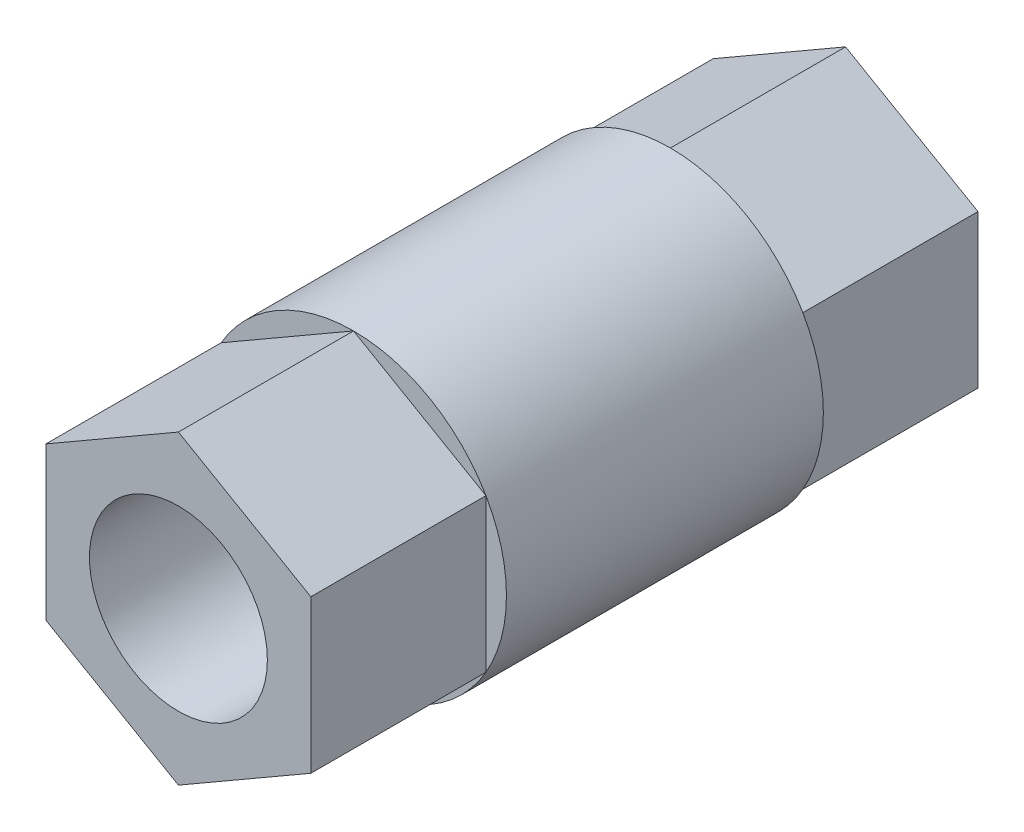
ISO-10303-21;
HEADER;
FILE_DESCRIPTION(('STEP AP214'),'2;1');
FILE_NAME('part.step','',(''),(''),'','','');
FILE_SCHEMA(('AUTOMOTIVE_DESIGN { 1 0 10303 214 1 1 1 1 }'));
ENDSEC;
DATA;
#1=APPLICATION_CONTEXT('core data for automotive mechanical design processes');
#2=APPLICATION_PROTOCOL_DEFINITION('international standard','automotive_design',2000,#1);
#3=PRODUCT_CONTEXT('',#1,'mechanical');
#4=PRODUCT('Part','Part','',(#3));
#5=PRODUCT_RELATED_PRODUCT_CATEGORY('part','',(#4));
#6=PRODUCT_DEFINITION_FORMATION('','',#4);
#7=PRODUCT_DEFINITION_CONTEXT('part definition',#1,'design');
#8=PRODUCT_DEFINITION('design','',#6,#7);
#9=PRODUCT_DEFINITION_SHAPE('','',#8);
#10=(LENGTH_UNIT() NAMED_UNIT(*) SI_UNIT(.MILLI.,.METRE.));
#11=(NAMED_UNIT(*) PLANE_ANGLE_UNIT() SI_UNIT($,.RADIAN.));
#12=(NAMED_UNIT(*) SI_UNIT($,.STERADIAN.) SOLID_ANGLE_UNIT());
#13=UNCERTAINTY_MEASURE_WITH_UNIT(LENGTH_MEASURE(1.E-05),#10,'distance_accuracy_value','');
#14=(GEOMETRIC_REPRESENTATION_CONTEXT(3) GLOBAL_UNCERTAINTY_ASSIGNED_CONTEXT((#13)) GLOBAL_UNIT_ASSIGNED_CONTEXT((#10,
#11,#12)) REPRESENTATION_CONTEXT('',''));
#15=CARTESIAN_POINT('',(0.,0.,0.));
#16=DIRECTION('',(0.,0.,1.));
#17=DIRECTION('',(1.,0.,0.));
#18=AXIS2_PLACEMENT_3D('',#15,#16,#17);
#19=CARTESIAN_POINT('',(0.,0.,11.4));
#20=DIRECTION('',(0.,0.,1.));
#21=DIRECTION('',(1.,0.,0.));
#22=AXIS2_PLACEMENT_3D('',#19,#20,#21);
#23=PLANE('',#22);
#24=CARTESIAN_POINT('',(0.,0.,11.4));
#25=DIRECTION('',(0.,0.,1.));
#26=DIRECTION('',(1.,0.,0.));
#27=AXIS2_PLACEMENT_3D('',#24,#25,#26);
#28=CIRCLE('',#27,11.);
#29=CARTESIAN_POINT('',(-9.52627944162882,5.5,11.4));
#30=VERTEX_POINT('',#29);
#31=CARTESIAN_POINT('',(-9.52627944162882,-5.5,11.4));
#32=VERTEX_POINT('',#31);
#33=EDGE_CURVE('E318',#30,#32,#28,.T.);
#34=ORIENTED_EDGE('',*,*,#33,.T.);
#35=DIRECTION('',(0.,1.,0.));
#36=VECTOR('',#35,1.);
#37=CARTESIAN_POINT('',(-9.52627944162882,0.,11.4));
#38=LINE('',#37,#36);
#39=EDGE_CURVE('E152',#32,#30,#38,.T.);
#40=ORIENTED_EDGE('',*,*,#39,.T.);
#41=EDGE_LOOP('',(#34,#40));
#42=FACE_BOUND('',#41,.T.);
#43=ADVANCED_FACE('F38',(#42),#23,.T.);
#44=CARTESIAN_POINT('',(0.,-11.,11.4));
#45=VERTEX_POINT('',#44);
#46=EDGE_CURVE('E319',#32,#45,#28,.T.);
#47=ORIENTED_EDGE('',*,*,#46,.T.);
#48=DIRECTION('',(-0.866025403784439,0.5,0.));
#49=VECTOR('',#48,1.);
#50=CARTESIAN_POINT('',(-4.76313972081441,-8.25,11.4));
#51=LINE('',#50,#49);
#52=EDGE_CURVE('E174',#45,#32,#51,.T.);
#53=ORIENTED_EDGE('',*,*,#52,.T.);
#54=EDGE_LOOP('',(#47,#53));
#55=FACE_BOUND('',#54,.T.);
#56=ADVANCED_FACE('F296',(#55),#23,.T.);
#57=CARTESIAN_POINT('',(9.52627944162883,-5.5,11.4));
#58=VERTEX_POINT('',#57);
#59=EDGE_CURVE('E321',#45,#58,#28,.T.);
#60=ORIENTED_EDGE('',*,*,#59,.T.);
#61=DIRECTION('',(-0.866025403784439,-0.5,0.));
#62=VECTOR('',#61,1.);
#63=CARTESIAN_POINT('',(4.76313972081441,-8.25,11.4));
#64=LINE('',#63,#62);
#65=EDGE_CURVE('E171',#58,#45,#64,.T.);
#66=ORIENTED_EDGE('',*,*,#65,.T.);
#67=EDGE_LOOP('',(#60,#66));
#68=FACE_BOUND('',#67,.T.);
#69=ADVANCED_FACE('F301',(#68),#23,.T.);
#70=CARTESIAN_POINT('',(9.52627944162882,5.5,11.4));
#71=VERTEX_POINT('',#70);
#72=EDGE_CURVE('E183',#58,#71,#28,.T.);
#73=ORIENTED_EDGE('',*,*,#72,.T.);
#74=DIRECTION('',(0.,-1.,0.));
#75=VECTOR('',#74,1.);
#76=CARTESIAN_POINT('',(9.52627944162882,0.,11.4));
#77=LINE('',#76,#75);
#78=EDGE_CURVE('E168',#71,#58,#77,.T.);
#79=ORIENTED_EDGE('',*,*,#78,.T.);
#80=EDGE_LOOP('',(#73,#79));
#81=FACE_BOUND('',#80,.T.);
#82=ADVANCED_FACE('F311',(#81),#23,.T.);
#83=CARTESIAN_POINT('',(0.,11.,11.4));
#84=VERTEX_POINT('',#83);
#85=EDGE_CURVE('E178',#71,#84,#28,.T.);
#86=ORIENTED_EDGE('',*,*,#85,.T.);
#87=DIRECTION('',(0.866025403784439,-0.5,0.));
#88=VECTOR('',#87,1.);
#89=CARTESIAN_POINT('',(4.76313972081441,8.25,11.4));
#90=LINE('',#89,#88);
#91=EDGE_CURVE('E161',#84,#71,#90,.T.);
#92=ORIENTED_EDGE('',*,*,#91,.T.);
#93=EDGE_LOOP('',(#86,#92));
#94=FACE_BOUND('',#93,.T.);
#95=ADVANCED_FACE('F306',(#94),#23,.T.);
#96=EDGE_CURVE('E182',#84,#30,#28,.T.);
#97=ORIENTED_EDGE('',*,*,#96,.T.);
#98=DIRECTION('',(0.866025403784439,0.5,0.));
#99=VECTOR('',#98,1.);
#100=CARTESIAN_POINT('',(-4.76313972081441,8.25,11.4));
#101=LINE('',#100,#99);
#102=EDGE_CURVE('E154',#30,#84,#101,.T.);
#103=ORIENTED_EDGE('',*,*,#102,.T.);
#104=EDGE_LOOP('',(#97,#103));
#105=FACE_BOUND('',#104,.T.);
#106=ADVANCED_FACE('F293',(#105),#23,.T.);
#107=CARTESIAN_POINT('',(0.,0.,-11.4));
#108=DIRECTION('',(0.,0.,1.));
#109=DIRECTION('',(1.,0.,0.));
#110=AXIS2_PLACEMENT_3D('',#107,#108,#109);
#111=PLANE('',#110);
#112=DIRECTION('',(0.,1.,0.));
#113=VECTOR('',#112,1.);
#114=CARTESIAN_POINT('',(-9.52627944162882,0.,-11.4));
#115=LINE('',#114,#113);
#116=CARTESIAN_POINT('',(-9.52627944162882,-5.50000000000001,-11.4));
#117=VERTEX_POINT('',#116);
#118=CARTESIAN_POINT('',(-9.52627944162883,5.5,-11.4));
#119=VERTEX_POINT('',#118);
#120=EDGE_CURVE('E11',#117,#119,#115,.T.);
#121=ORIENTED_EDGE('',*,*,#120,.F.);
#122=CARTESIAN_POINT('',(0.,0.,-11.4));
#123=DIRECTION('',(0.,0.,1.));
#124=DIRECTION('',(1.,0.,0.));
#125=AXIS2_PLACEMENT_3D('',#122,#123,#124);
#126=CIRCLE('',#125,11.);
#127=EDGE_CURVE('E275',#119,#117,#126,.T.);
#128=ORIENTED_EDGE('',*,*,#127,.F.);
#129=EDGE_LOOP('',(#121,#128));
#130=FACE_BOUND('',#129,.T.);
#131=ADVANCED_FACE('F276',(#130),#111,.F.);
#132=DIRECTION('',(-0.866025403784439,0.5,0.));
#133=VECTOR('',#132,1.);
#134=CARTESIAN_POINT('',(-4.76313972081441,-8.25,-11.4));
#135=LINE('',#134,#133);
#136=CARTESIAN_POINT('',(0.,-11.,-11.4));
#137=VERTEX_POINT('',#136);
#138=EDGE_CURVE('E46',#137,#117,#135,.T.);
#139=ORIENTED_EDGE('',*,*,#138,.F.);
#140=EDGE_CURVE('E279',#117,#137,#126,.T.);
#141=ORIENTED_EDGE('',*,*,#140,.F.);
#142=EDGE_LOOP('',(#139,#141));
#143=FACE_BOUND('',#142,.T.);
#144=ADVANCED_FACE('F284',(#143),#111,.F.);
#145=DIRECTION('',(-0.866025403784439,-0.5,0.));
#146=VECTOR('',#145,1.);
#147=CARTESIAN_POINT('',(4.76313972081441,-8.25,-11.4));
#148=LINE('',#147,#146);
#149=CARTESIAN_POINT('',(9.52627944162883,-5.5,-11.4));
#150=VERTEX_POINT('',#149);
#151=EDGE_CURVE('E60',#150,#137,#148,.T.);
#152=ORIENTED_EDGE('',*,*,#151,.F.);
#153=EDGE_CURVE('E282',#137,#150,#126,.T.);
#154=ORIENTED_EDGE('',*,*,#153,.F.);
#155=EDGE_LOOP('',(#152,#154));
#156=FACE_BOUND('',#155,.T.);
#157=ADVANCED_FACE('F286',(#156),#111,.F.);
#158=DIRECTION('',(0.,-1.,0.));
#159=VECTOR('',#158,1.);
#160=CARTESIAN_POINT('',(9.52627944162882,0.,-11.4));
#161=LINE('',#160,#159);
#162=CARTESIAN_POINT('',(9.52627944162882,5.50000000000001,-11.4));
#163=VERTEX_POINT('',#162);
#164=EDGE_CURVE('E192',#163,#150,#161,.T.);
#165=ORIENTED_EDGE('',*,*,#164,.F.);
#166=EDGE_CURVE('E177',#150,#163,#126,.T.);
#167=ORIENTED_EDGE('',*,*,#166,.F.);
#168=EDGE_LOOP('',(#165,#167));
#169=FACE_BOUND('',#168,.T.);
#170=ADVANCED_FACE('F292',(#169),#111,.F.);
#171=DIRECTION('',(0.866025403784439,-0.5,0.));
#172=VECTOR('',#171,1.);
#173=CARTESIAN_POINT('',(4.76313972081441,8.25,-11.4));
#174=LINE('',#173,#172);
#175=CARTESIAN_POINT('',(0.,11.,-11.4));
#176=VERTEX_POINT('',#175);
#177=EDGE_CURVE('E189',#176,#163,#174,.T.);
#178=ORIENTED_EDGE('',*,*,#177,.F.);
#179=EDGE_CURVE('E184',#163,#176,#126,.T.);
#180=ORIENTED_EDGE('',*,*,#179,.F.);
#181=EDGE_LOOP('',(#178,#180));
#182=FACE_BOUND('',#181,.T.);
#183=ADVANCED_FACE('F265',(#182),#111,.F.);
#184=DIRECTION('',(0.866025403784439,0.5,0.));
#185=VECTOR('',#184,1.);
#186=CARTESIAN_POINT('',(-4.76313972081441,8.25,-11.4));
#187=LINE('',#186,#185);
#188=EDGE_CURVE('E181',#119,#176,#187,.T.);
#189=ORIENTED_EDGE('',*,*,#188,.F.);
#190=EDGE_CURVE('E186',#176,#119,#126,.T.);
#191=ORIENTED_EDGE('',*,*,#190,.F.);
#192=EDGE_LOOP('',(#189,#191));
#193=FACE_BOUND('',#192,.T.);
#194=ADVANCED_FACE('F271',(#193),#111,.F.);
#195=CARTESIAN_POINT('',(0.,0.,11.4));
#196=DIRECTION('',(0.,0.,-1.));
#197=DIRECTION('',(-1.,0.,0.));
#198=AXIS2_PLACEMENT_3D('',#195,#196,#197);
#199=CYLINDRICAL_SURFACE('',#198,11.);
#200=ORIENTED_EDGE('',*,*,#46,.F.);
#201=ORIENTED_EDGE('',*,*,#33,.F.);
#202=ORIENTED_EDGE('',*,*,#96,.F.);
#203=ORIENTED_EDGE('',*,*,#85,.F.);
#204=ORIENTED_EDGE('',*,*,#72,.F.);
#205=ORIENTED_EDGE('',*,*,#59,.F.);
#206=EDGE_LOOP('',(#200,#201,#202,#203,#204,#205));
#207=FACE_BOUND('',#206,.T.);
#208=ORIENTED_EDGE('',*,*,#127,.T.);
#209=ORIENTED_EDGE('',*,*,#140,.T.);
#210=ORIENTED_EDGE('',*,*,#153,.T.);
#211=ORIENTED_EDGE('',*,*,#166,.T.);
#212=ORIENTED_EDGE('',*,*,#179,.T.);
#213=ORIENTED_EDGE('',*,*,#190,.T.);
#214=EDGE_LOOP('',(#208,#209,#210,#211,#212,#213));
#215=FACE_BOUND('',#214,.T.);
#216=ADVANCED_FACE('F40',(#207,#215),#199,.T.);
#217=CARTESIAN_POINT('',(0.,0.,-24.));
#218=DIRECTION('',(0.,0.,1.));
#219=DIRECTION('',(1.,0.,0.));
#220=AXIS2_PLACEMENT_3D('',#217,#218,#219);
#221=PLANE('',#220);
#222=CARTESIAN_POINT('',(0.,0.,-24.));
#223=DIRECTION('',(0.,0.,1.));
#224=DIRECTION('',(1.,0.,0.));
#225=AXIS2_PLACEMENT_3D('',#222,#223,#224);
#226=CIRCLE('',#225,6.4);
#227=CARTESIAN_POINT('',(6.4,0.,-24.));
#228=VERTEX_POINT('',#227);
#229=EDGE_CURVE('E217',#228,#228,#226,.T.);
#230=ORIENTED_EDGE('',*,*,#229,.T.);
#231=EDGE_LOOP('',(#230));
#232=FACE_BOUND('',#231,.T.);
#233=DIRECTION('',(0.,-1.,0.));
#234=VECTOR('',#233,1.);
#235=CARTESIAN_POINT('',(-9.52627944162882,0.,-24.));
#236=LINE('',#235,#234);
#237=CARTESIAN_POINT('',(-9.52627944162882,5.5,-24.));
#238=VERTEX_POINT('',#237);
#239=CARTESIAN_POINT('',(-9.52627944162882,-5.5,-24.));
#240=VERTEX_POINT('',#239);
#241=EDGE_CURVE('E211',#238,#240,#236,.T.);
#242=ORIENTED_EDGE('',*,*,#241,.F.);
#243=DIRECTION('',(-0.866025403784439,-0.5,0.));
#244=VECTOR('',#243,1.);
#245=CARTESIAN_POINT('',(-4.76313972081441,8.25,-24.));
#246=LINE('',#245,#244);
#247=CARTESIAN_POINT('',(0.,11.,-24.));
#248=VERTEX_POINT('',#247);
#249=EDGE_CURVE('E233',#248,#238,#246,.T.);
#250=ORIENTED_EDGE('',*,*,#249,.F.);
#251=DIRECTION('',(-0.866025403784439,0.5,0.));
#252=VECTOR('',#251,1.);
#253=CARTESIAN_POINT('',(4.76313972081441,8.25,-24.));
#254=LINE('',#253,#252);
#255=CARTESIAN_POINT('',(9.52627944162882,5.5,-24.));
#256=VERTEX_POINT('',#255);
#257=EDGE_CURVE('E230',#256,#248,#254,.T.);
#258=ORIENTED_EDGE('',*,*,#257,.F.);
#259=DIRECTION('',(0.,1.,0.));
#260=VECTOR('',#259,1.);
#261=CARTESIAN_POINT('',(9.52627944162882,0.,-24.));
#262=LINE('',#261,#260);
#263=CARTESIAN_POINT('',(9.52627944162883,-5.5,-24.));
#264=VERTEX_POINT('',#263);
#265=EDGE_CURVE('E227',#264,#256,#262,.T.);
#266=ORIENTED_EDGE('',*,*,#265,.F.);
#267=DIRECTION('',(0.866025403784439,0.5,0.));
#268=VECTOR('',#267,1.);
#269=CARTESIAN_POINT('',(4.76313972081441,-8.25,-24.));
#270=LINE('',#269,#268);
#271=CARTESIAN_POINT('',(0.,-11.,-24.));
#272=VERTEX_POINT('',#271);
#273=EDGE_CURVE('E219',#272,#264,#270,.T.);
#274=ORIENTED_EDGE('',*,*,#273,.F.);
#275=DIRECTION('',(0.866025403784439,-0.5,0.));
#276=VECTOR('',#275,1.);
#277=CARTESIAN_POINT('',(-4.76313972081441,-8.25,-24.));
#278=LINE('',#277,#276);
#279=EDGE_CURVE('E216',#240,#272,#278,.T.);
#280=ORIENTED_EDGE('',*,*,#279,.F.);
#281=EDGE_LOOP('',(#242,#250,#258,#266,#274,#280));
#282=FACE_BOUND('',#281,.T.);
#283=ADVANCED_FACE('F258',(#232,#282),#221,.F.);
#284=CARTESIAN_POINT('',(-4.76313972081441,8.25,24.));
#285=DIRECTION('',(0.5,-0.866025403784439,0.));
#286=DIRECTION('',(0.866025403784439,0.5,0.));
#287=AXIS2_PLACEMENT_3D('',#284,#285,#286);
#288=PLANE('',#287);
#289=DIRECTION('',(0.,0.,-1.));
#290=VECTOR('',#289,1.);
#291=CARTESIAN_POINT('',(-9.52627944162882,5.5,24.));
#292=LINE('',#291,#290);
#293=EDGE_CURVE('E212',#119,#238,#292,.T.);
#294=ORIENTED_EDGE('',*,*,#293,.F.);
#295=ORIENTED_EDGE('',*,*,#188,.T.);
#296=DIRECTION('',(0.,0.,-1.));
#297=VECTOR('',#296,1.);
#298=CARTESIAN_POINT('',(0.,11.,24.));
#299=LINE('',#298,#297);
#300=EDGE_CURVE('E237',#176,#248,#299,.T.);
#301=ORIENTED_EDGE('',*,*,#300,.T.);
#302=ORIENTED_EDGE('',*,*,#249,.T.);
#303=EDGE_LOOP('',(#294,#295,#301,#302));
#304=FACE_BOUND('',#303,.T.);
#305=ADVANCED_FACE('F267',(#304),#288,.F.);
#306=CARTESIAN_POINT('',(4.76313972081441,8.25,24.));
#307=DIRECTION('',(-0.5,-0.866025403784439,0.));
#308=DIRECTION('',(0.866025403784439,-0.5,0.));
#309=AXIS2_PLACEMENT_3D('',#306,#307,#308);
#310=PLANE('',#309);
#311=ORIENTED_EDGE('',*,*,#300,.F.);
#312=ORIENTED_EDGE('',*,*,#177,.T.);
#313=DIRECTION('',(0.,0.,-1.));
#314=VECTOR('',#313,1.);
#315=CARTESIAN_POINT('',(9.52627944162882,5.5,24.));
#316=LINE('',#315,#314);
#317=EDGE_CURVE('E239',#163,#256,#316,.T.);
#318=ORIENTED_EDGE('',*,*,#317,.T.);
#319=ORIENTED_EDGE('',*,*,#257,.T.);
#320=EDGE_LOOP('',(#311,#312,#318,#319));
#321=FACE_BOUND('',#320,.T.);
#322=ADVANCED_FACE('F261',(#321),#310,.F.);
#323=CARTESIAN_POINT('',(9.52627944162882,0.,24.));
#324=DIRECTION('',(-1.,0.,0.));
#325=DIRECTION('',(0.,-1.,0.));
#326=AXIS2_PLACEMENT_3D('',#323,#324,#325);
#327=PLANE('',#326);
#328=ORIENTED_EDGE('',*,*,#317,.F.);
#329=ORIENTED_EDGE('',*,*,#164,.T.);
#330=DIRECTION('',(0.,0.,-1.));
#331=VECTOR('',#330,1.);
#332=CARTESIAN_POINT('',(9.52627944162883,-5.5,24.));
#333=LINE('',#332,#331);
#334=EDGE_CURVE('E242',#150,#264,#333,.T.);
#335=ORIENTED_EDGE('',*,*,#334,.T.);
#336=ORIENTED_EDGE('',*,*,#265,.T.);
#337=EDGE_LOOP('',(#328,#329,#335,#336));
#338=FACE_BOUND('',#337,.T.);
#339=ADVANCED_FACE('F252',(#338),#327,.F.);
#340=CARTESIAN_POINT('',(4.76313972081441,-8.25,24.));
#341=DIRECTION('',(-0.5,0.866025403784439,0.));
#342=DIRECTION('',(-0.866025403784439,-0.5,0.));
#343=AXIS2_PLACEMENT_3D('',#340,#341,#342);
#344=PLANE('',#343);
#345=ORIENTED_EDGE('',*,*,#334,.F.);
#346=ORIENTED_EDGE('',*,*,#151,.T.);
#347=DIRECTION('',(0.,0.,-1.));
#348=VECTOR('',#347,1.);
#349=CARTESIAN_POINT('',(0.,-11.,24.));
#350=LINE('',#349,#348);
#351=EDGE_CURVE('E203',#137,#272,#350,.T.);
#352=ORIENTED_EDGE('',*,*,#351,.T.);
#353=ORIENTED_EDGE('',*,*,#273,.T.);
#354=EDGE_LOOP('',(#345,#346,#352,#353));
#355=FACE_BOUND('',#354,.T.);
#356=ADVANCED_FACE('F257',(#355),#344,.F.);
#357=CARTESIAN_POINT('',(-4.76313972081441,-8.25,24.));
#358=DIRECTION('',(0.5,0.866025403784439,0.));
#359=DIRECTION('',(-0.866025403784439,0.5,0.));
#360=AXIS2_PLACEMENT_3D('',#357,#358,#359);
#361=PLANE('',#360);
#362=ORIENTED_EDGE('',*,*,#351,.F.);
#363=ORIENTED_EDGE('',*,*,#138,.T.);
#364=DIRECTION('',(0.,0.,-1.));
#365=VECTOR('',#364,1.);
#366=CARTESIAN_POINT('',(-9.52627944162882,-5.5,24.));
#367=LINE('',#366,#365);
#368=EDGE_CURVE('E155',#117,#240,#367,.T.);
#369=ORIENTED_EDGE('',*,*,#368,.T.);
#370=ORIENTED_EDGE('',*,*,#279,.T.);
#371=EDGE_LOOP('',(#362,#363,#369,#370));
#372=FACE_BOUND('',#371,.T.);
#373=ADVANCED_FACE('F200',(#372),#361,.F.);
#374=CARTESIAN_POINT('',(-9.52627944162882,0.,24.));
#375=DIRECTION('',(1.,0.,0.));
#376=DIRECTION('',(0.,1.,0.));
#377=AXIS2_PLACEMENT_3D('',#374,#375,#376);
#378=PLANE('',#377);
#379=ORIENTED_EDGE('',*,*,#368,.F.);
#380=ORIENTED_EDGE('',*,*,#120,.T.);
#381=ORIENTED_EDGE('',*,*,#293,.T.);
#382=ORIENTED_EDGE('',*,*,#241,.T.);
#383=EDGE_LOOP('',(#379,#380,#381,#382));
#384=FACE_BOUND('',#383,.T.);
#385=ADVANCED_FACE('F208',(#384),#378,.F.);
#386=CARTESIAN_POINT('',(0.,0.,11.4));
#387=DIRECTION('',(0.,0.,-1.));
#388=DIRECTION('',(-1.,0.,0.));
#389=AXIS2_PLACEMENT_3D('',#386,#387,#388);
#390=CYLINDRICAL_SURFACE('',#389,6.4);
#391=ORIENTED_EDGE('',*,*,#229,.F.);
#392=EDGE_LOOP('',(#391));
#393=FACE_BOUND('',#392,.T.);
#394=CARTESIAN_POINT('',(0.,0.,24.));
#395=DIRECTION('',(0.,0.,1.));
#396=DIRECTION('',(1.,0.,0.));
#397=AXIS2_PLACEMENT_3D('',#394,#395,#396);
#398=CIRCLE('',#397,6.4);
#399=CARTESIAN_POINT('',(6.4,0.,24.));
#400=VERTEX_POINT('',#399);
#401=EDGE_CURVE('E148',#400,#400,#398,.T.);
#402=ORIENTED_EDGE('',*,*,#401,.T.);
#403=EDGE_LOOP('',(#402));
#404=FACE_BOUND('',#403,.T.);
#405=ADVANCED_FACE('F349',(#393,#404),#390,.F.);
#406=ORIENTED_EDGE('',*,*,#39,.F.);
#407=CARTESIAN_POINT('',(-9.52627944162882,-5.5,24.));
#408=VERTEX_POINT('',#407);
#409=EDGE_CURVE('E133',#408,#32,#367,.T.);
#410=ORIENTED_EDGE('',*,*,#409,.F.);
#411=DIRECTION('',(0.,-1.,0.));
#412=VECTOR('',#411,1.);
#413=CARTESIAN_POINT('',(-9.52627944162882,0.,24.));
#414=LINE('',#413,#412);
#415=CARTESIAN_POINT('',(-9.52627944162882,5.5,24.));
#416=VERTEX_POINT('',#415);
#417=EDGE_CURVE('E140',#416,#408,#414,.T.);
#418=ORIENTED_EDGE('',*,*,#417,.F.);
#419=EDGE_CURVE('E235',#416,#30,#292,.T.);
#420=ORIENTED_EDGE('',*,*,#419,.T.);
#421=EDGE_LOOP('',(#406,#410,#418,#420));
#422=FACE_BOUND('',#421,.T.);
#423=ADVANCED_FACE('F150',(#422),#378,.F.);
#424=ORIENTED_EDGE('',*,*,#52,.F.);
#425=CARTESIAN_POINT('',(0.,-11.,24.));
#426=VERTEX_POINT('',#425);
#427=EDGE_CURVE('E136',#426,#45,#350,.T.);
#428=ORIENTED_EDGE('',*,*,#427,.F.);
#429=DIRECTION('',(0.866025403784439,-0.5,0.));
#430=VECTOR('',#429,1.);
#431=CARTESIAN_POINT('',(-4.76313972081441,-8.25,24.));
#432=LINE('',#431,#430);
#433=EDGE_CURVE('E129',#408,#426,#432,.T.);
#434=ORIENTED_EDGE('',*,*,#433,.F.);
#435=ORIENTED_EDGE('',*,*,#409,.T.);
#436=EDGE_LOOP('',(#424,#428,#434,#435));
#437=FACE_BOUND('',#436,.T.);
#438=ADVANCED_FACE('F131',(#437),#361,.F.);
#439=ORIENTED_EDGE('',*,*,#65,.F.);
#440=CARTESIAN_POINT('',(9.52627944162883,-5.5,24.));
#441=VERTEX_POINT('',#440);
#442=EDGE_CURVE('E243',#441,#58,#333,.T.);
#443=ORIENTED_EDGE('',*,*,#442,.F.);
#444=DIRECTION('',(0.866025403784439,0.5,0.));
#445=VECTOR('',#444,1.);
#446=CARTESIAN_POINT('',(4.76313972081441,-8.25,24.));
#447=LINE('',#446,#445);
#448=EDGE_CURVE('E139',#426,#441,#447,.T.);
#449=ORIENTED_EDGE('',*,*,#448,.F.);
#450=ORIENTED_EDGE('',*,*,#427,.T.);
#451=EDGE_LOOP('',(#439,#443,#449,#450));
#452=FACE_BOUND('',#451,.T.);
#453=ADVANCED_FACE('F366',(#452),#344,.F.);
#454=ORIENTED_EDGE('',*,*,#78,.F.);
#455=CARTESIAN_POINT('',(9.52627944162882,5.5,24.));
#456=VERTEX_POINT('',#455);
#457=EDGE_CURVE('E240',#456,#71,#316,.T.);
#458=ORIENTED_EDGE('',*,*,#457,.F.);
#459=DIRECTION('',(0.,1.,0.));
#460=VECTOR('',#459,1.);
#461=CARTESIAN_POINT('',(9.52627944162882,0.,24.));
#462=LINE('',#461,#460);
#463=EDGE_CURVE('E335',#441,#456,#462,.T.);
#464=ORIENTED_EDGE('',*,*,#463,.F.);
#465=ORIENTED_EDGE('',*,*,#442,.T.);
#466=EDGE_LOOP('',(#454,#458,#464,#465));
#467=FACE_BOUND('',#466,.T.);
#468=ADVANCED_FACE('F334',(#467),#327,.F.);
#469=ORIENTED_EDGE('',*,*,#91,.F.);
#470=CARTESIAN_POINT('',(0.,11.,24.));
#471=VERTEX_POINT('',#470);
#472=EDGE_CURVE('E53',#471,#84,#299,.T.);
#473=ORIENTED_EDGE('',*,*,#472,.F.);
#474=DIRECTION('',(-0.866025403784439,0.5,0.));
#475=VECTOR('',#474,1.);
#476=CARTESIAN_POINT('',(4.76313972081441,8.25,24.));
#477=LINE('',#476,#475);
#478=EDGE_CURVE('E333',#456,#471,#477,.T.);
#479=ORIENTED_EDGE('',*,*,#478,.F.);
#480=ORIENTED_EDGE('',*,*,#457,.T.);
#481=EDGE_LOOP('',(#469,#473,#479,#480));
#482=FACE_BOUND('',#481,.T.);
#483=ADVANCED_FACE('F330',(#482),#310,.F.);
#484=ORIENTED_EDGE('',*,*,#102,.F.);
#485=ORIENTED_EDGE('',*,*,#419,.F.);
#486=DIRECTION('',(-0.866025403784439,-0.5,0.));
#487=VECTOR('',#486,1.);
#488=CARTESIAN_POINT('',(-4.76313972081441,8.25,24.));
#489=LINE('',#488,#487);
#490=EDGE_CURVE('E144',#471,#416,#489,.T.);
#491=ORIENTED_EDGE('',*,*,#490,.F.);
#492=ORIENTED_EDGE('',*,*,#472,.T.);
#493=EDGE_LOOP('',(#484,#485,#491,#492));
#494=FACE_BOUND('',#493,.T.);
#495=ADVANCED_FACE('F352',(#494),#288,.F.);
#496=CARTESIAN_POINT('',(0.,0.,24.));
#497=DIRECTION('',(0.,0.,1.));
#498=DIRECTION('',(1.,0.,0.));
#499=AXIS2_PLACEMENT_3D('',#496,#497,#498);
#500=PLANE('',#499);
#501=ORIENTED_EDGE('',*,*,#401,.F.);
#502=EDGE_LOOP('',(#501));
#503=FACE_BOUND('',#502,.T.);
#504=ORIENTED_EDGE('',*,*,#417,.T.);
#505=ORIENTED_EDGE('',*,*,#433,.T.);
#506=ORIENTED_EDGE('',*,*,#448,.T.);
#507=ORIENTED_EDGE('',*,*,#463,.T.);
#508=ORIENTED_EDGE('',*,*,#478,.T.);
#509=ORIENTED_EDGE('',*,*,#490,.T.);
#510=EDGE_LOOP('',(#504,#505,#506,#507,#508,#509));
#511=FACE_BOUND('',#510,.T.);
#512=ADVANCED_FACE('F143',(#503,#511),#500,.T.);
#513=CLOSED_SHELL('',(#43,#56,#69,#82,#95,#106,#131,#144,#157,#170,#183,#194,#216,#283,#305,
#322,#339,#356,#373,#385,#405,#423,#438,#453,#468,#483,#495,#512));
#514=MANIFOLD_SOLID_BREP('B2',#513);
#515=ADVANCED_BREP_SHAPE_REPRESENTATION('',(#18,#514),#14);
#516=SHAPE_DEFINITION_REPRESENTATION(#9,#515);
ENDSEC;
END-ISO-10303-21;
